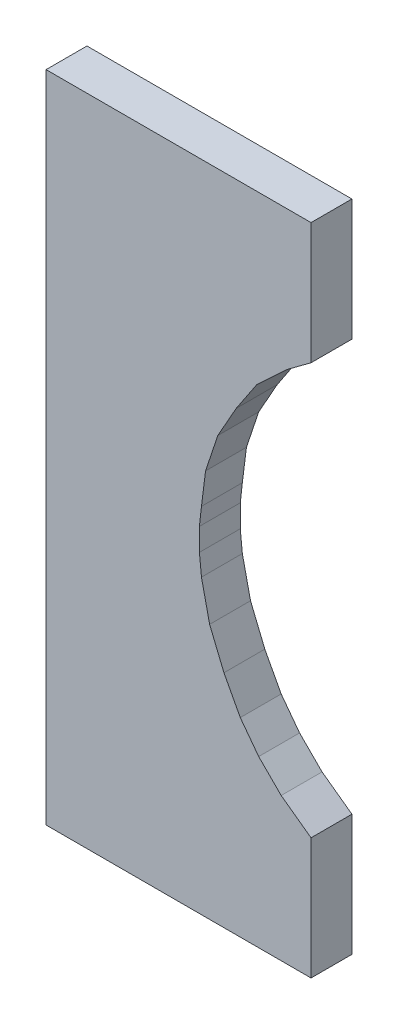
ISO-10303-21;
HEADER;
FILE_DESCRIPTION(('STEP AP214'),'2;1');
FILE_NAME('part.step','',(''),(''),'','','');
FILE_SCHEMA(('AUTOMOTIVE_DESIGN { 1 0 10303 214 1 1 1 1 }'));
ENDSEC;
DATA;
#1=APPLICATION_CONTEXT('core data for automotive mechanical design processes');
#2=APPLICATION_PROTOCOL_DEFINITION('international standard','automotive_design',2000,#1);
#3=PRODUCT_CONTEXT('',#1,'mechanical');
#4=PRODUCT('Part','Part','',(#3));
#5=PRODUCT_RELATED_PRODUCT_CATEGORY('part','',(#4));
#6=PRODUCT_DEFINITION_FORMATION('','',#4);
#7=PRODUCT_DEFINITION_CONTEXT('part definition',#1,'design');
#8=PRODUCT_DEFINITION('design','',#6,#7);
#9=PRODUCT_DEFINITION_SHAPE('','',#8);
#10=(LENGTH_UNIT() NAMED_UNIT(*) SI_UNIT(.MILLI.,.METRE.));
#11=(NAMED_UNIT(*) PLANE_ANGLE_UNIT() SI_UNIT($,.RADIAN.));
#12=(NAMED_UNIT(*) SI_UNIT($,.STERADIAN.) SOLID_ANGLE_UNIT());
#13=UNCERTAINTY_MEASURE_WITH_UNIT(LENGTH_MEASURE(1.E-05),#10,'distance_accuracy_value','');
#14=(GEOMETRIC_REPRESENTATION_CONTEXT(3) GLOBAL_UNCERTAINTY_ASSIGNED_CONTEXT((#13)) GLOBAL_UNIT_ASSIGNED_CONTEXT((#10,
#11,#12)) REPRESENTATION_CONTEXT('',''));
#15=CARTESIAN_POINT('',(0.,0.,0.));
#16=DIRECTION('',(0.,0.,1.));
#17=DIRECTION('',(1.,0.,0.));
#18=AXIS2_PLACEMENT_3D('',#15,#16,#17);
#19=CARTESIAN_POINT('',(-0.64800734,1.60000188,0.2));
#20=DIRECTION('',(0.,0.,1.));
#21=DIRECTION('',(1.,0.,0.));
#22=AXIS2_PLACEMENT_3D('',#19,#20,#21);
#23=PLANE('',#22);
#24=DIRECTION('',(0.,1.,0.));
#25=VECTOR('',#24,1.);
#26=CARTESIAN_POINT('',(0.64800734,1.60000188,0.2));
#27=LINE('',#26,#25);
#28=CARTESIAN_POINT('',(0.64800734,1.00612956,0.2));
#29=VERTEX_POINT('',#28);
#30=CARTESIAN_POINT('',(0.64800734,1.60000188,0.2));
#31=VERTEX_POINT('',#30);
#32=EDGE_CURVE('E225',#29,#31,#27,.T.);
#33=ORIENTED_EDGE('',*,*,#32,.T.);
#34=DIRECTION('',(1.,0.,0.));
#35=VECTOR('',#34,1.);
#36=CARTESIAN_POINT('',(-0.64800734,1.60000188,0.2));
#37=LINE('',#36,#35);
#38=CARTESIAN_POINT('',(-0.64800734,1.60000188,0.2));
#39=VERTEX_POINT('',#38);
#40=EDGE_CURVE('E228',#31,#39,#37,.F.);
#41=ORIENTED_EDGE('',*,*,#40,.T.);
#42=DIRECTION('',(0.,1.,0.));
#43=VECTOR('',#42,1.);
#44=CARTESIAN_POINT('',(-0.64800734,-1.59999934,0.2));
#45=LINE('',#44,#43);
#46=CARTESIAN_POINT('',(-0.64800734,-1.59999934,0.2));
#47=VERTEX_POINT('',#46);
#48=EDGE_CURVE('E156',#47,#39,#45,.T.);
#49=ORIENTED_EDGE('',*,*,#48,.F.);
#50=DIRECTION('',(1.,0.,0.));
#51=VECTOR('',#50,1.);
#52=CARTESIAN_POINT('',(-0.64800734,-1.59999934,0.2));
#53=LINE('',#52,#51);
#54=CARTESIAN_POINT('',(0.64800734,-1.59999934,0.2));
#55=VERTEX_POINT('',#54);
#56=EDGE_CURVE('E19',#47,#55,#53,.T.);
#57=ORIENTED_EDGE('',*,*,#56,.T.);
#58=DIRECTION('',(0.,1.,0.));
#59=VECTOR('',#58,1.);
#60=CARTESIAN_POINT('',(0.64800734,1.60000188,0.2));
#61=LINE('',#60,#59);
#62=CARTESIAN_POINT('',(0.648007339999998,-1.00612702,0.2));
#63=VERTEX_POINT('',#62);
#64=EDGE_CURVE('E151',#55,#63,#61,.T.);
#65=ORIENTED_EDGE('',*,*,#64,.T.);
#66=DIRECTION('',(-0.80890338608326,0.587941588921073,0.));
#67=VECTOR('',#66,1.);
#68=CARTESIAN_POINT('',(0.64800734,-1.00612702,0.2));
#69=LINE('',#68,#67);
#70=CARTESIAN_POINT('',(0.5019929,-0.8999982,0.2));
#71=VERTEX_POINT('',#70);
#72=EDGE_CURVE('E175',#63,#71,#69,.T.);
#73=ORIENTED_EDGE('',*,*,#72,.T.);
#74=DIRECTION('',(-0.707106781186547,0.707106781186548,0.));
#75=VECTOR('',#74,1.);
#76=CARTESIAN_POINT('',(0.5019929,-0.8999982,0.2));
#77=LINE('',#76,#75);
#78=CARTESIAN_POINT('',(0.39199312,-0.78999842,0.2));
#79=VERTEX_POINT('',#78);
#80=EDGE_CURVE('E181',#71,#79,#77,.T.);
#81=ORIENTED_EDGE('',*,*,#80,.T.);
#82=DIRECTION('',(-0.6,0.8,0.));
#83=VECTOR('',#82,1.);
#84=CARTESIAN_POINT('',(0.39199312,-0.78999842,0.2));
#85=LINE('',#84,#83);
#86=CARTESIAN_POINT('',(0.301993300000005,-0.669998659999998,0.2));
#87=VERTEX_POINT('',#86);
#88=EDGE_CURVE('E186',#79,#87,#85,.T.);
#89=ORIENTED_EDGE('',*,*,#88,.T.);
#90=DIRECTION('',(-0.470588235294118,0.88235294117647,0.));
#91=VECTOR('',#90,1.);
#92=CARTESIAN_POINT('',(0.3019933,-0.66999866,0.2));
#93=LINE('',#92,#91);
#94=CARTESIAN_POINT('',(0.221993459999983,-0.519998960000006,0.2));
#95=VERTEX_POINT('',#94);
#96=EDGE_CURVE('E189',#87,#95,#93,.T.);
#97=ORIENTED_EDGE('',*,*,#96,.T.);
#98=DIRECTION('',(-0.380749805254294,0.924678098474716,0.));
#99=VECTOR('',#98,1.);
#100=CARTESIAN_POINT('',(0.22199346,-0.51999896,0.2));
#101=LINE('',#100,#99);
#102=CARTESIAN_POINT('',(0.151993600000015,-0.3499993,0.2));
#103=VERTEX_POINT('',#102);
#104=EDGE_CURVE('E192',#95,#103,#101,.T.);
#105=ORIENTED_EDGE('',*,*,#104,.T.);
#106=DIRECTION('',(-0.216930457818656,0.976187060183953,0.));
#107=VECTOR('',#106,1.);
#108=CARTESIAN_POINT('',(0.1519936,-0.3499993,0.2));
#109=LINE('',#108,#107);
#110=CARTESIAN_POINT('',(0.11199368,-0.169999659999998,0.2));
#111=VERTEX_POINT('',#110);
#112=EDGE_CURVE('E195',#103,#111,#109,.T.);
#113=ORIENTED_EDGE('',*,*,#112,.T.);
#114=DIRECTION('',(-0.0995037190209989,0.995037190209989,0.));
#115=VECTOR('',#114,1.);
#116=CARTESIAN_POINT('',(0.11199368,-0.16999966,0.2));
#117=LINE('',#116,#115);
#118=CARTESIAN_POINT('',(0.1019937,-0.0699998600000053,0.2));
#119=VERTEX_POINT('',#118);
#120=EDGE_CURVE('E198',#111,#119,#117,.T.);
#121=ORIENTED_EDGE('',*,*,#120,.T.);
#122=DIRECTION('',(0.,1.,0.));
#123=VECTOR('',#122,1.);
#124=CARTESIAN_POINT('',(0.1019937,1.60000188,0.2));
#125=LINE('',#124,#123);
#126=CARTESIAN_POINT('',(0.101993699999997,0.0399999199999908,0.2));
#127=VERTEX_POINT('',#126);
#128=EDGE_CURVE('E201',#119,#127,#125,.T.);
#129=ORIENTED_EDGE('',*,*,#128,.T.);
#130=DIRECTION('',(0.110431526074846,0.993883734673619,0.));
#131=VECTOR('',#130,1.);
#132=CARTESIAN_POINT('',(0.1019937,0.03999992,0.2));
#133=LINE('',#132,#131);
#134=CARTESIAN_POINT('',(0.111993680000012,0.129999740000016,0.2));
#135=VERTEX_POINT('',#134);
#136=EDGE_CURVE('E204',#127,#135,#133,.T.);
#137=ORIENTED_EDGE('',*,*,#136,.T.);
#138=DIRECTION('',(0.124034734589208,0.992277876713668,0.));
#139=VECTOR('',#138,1.);
#140=CARTESIAN_POINT('',(0.11199368,0.12999974,0.2));
#141=LINE('',#140,#139);
#142=CARTESIAN_POINT('',(0.131993640000011,0.289999419999996,0.2));
#143=VERTEX_POINT('',#142);
#144=EDGE_CURVE('E207',#135,#143,#141,.T.);
#145=ORIENTED_EDGE('',*,*,#144,.T.);
#146=DIRECTION('',(0.316223749964347,0.948684636725232,0.));
#147=VECTOR('',#146,1.);
#148=CARTESIAN_POINT('',(0.13199364,0.28999942,0.2));
#149=LINE('',#148,#147);
#150=CARTESIAN_POINT('',(0.191993519999974,0.470001600000015,0.2));
#151=VERTEX_POINT('',#150);
#152=EDGE_CURVE('E210',#143,#151,#149,.T.);
#153=ORIENTED_EDGE('',*,*,#152,.T.);
#154=DIRECTION('',(0.490261239632559,0.871575537124549,0.));
#155=VECTOR('',#154,1.);
#156=CARTESIAN_POINT('',(0.19199352,0.4700016,0.2));
#157=LINE('',#156,#155);
#158=CARTESIAN_POINT('',(0.281993340000012,0.630001279999995,0.2));
#159=VERTEX_POINT('',#158);
#160=EDGE_CURVE('E213',#151,#159,#157,.T.);
#161=ORIENTED_EDGE('',*,*,#160,.T.);
#162=DIRECTION('',(0.55470019622523,0.832050294337843,0.));
#163=VECTOR('',#162,1.);
#164=CARTESIAN_POINT('',(0.28199334,0.63000128,0.2));
#165=LINE('',#164,#163);
#166=CARTESIAN_POINT('',(0.381993139999997,0.780000980000003,0.2));
#167=VERTEX_POINT('',#166);
#168=EDGE_CURVE('E216',#159,#167,#165,.T.);
#169=ORIENTED_EDGE('',*,*,#168,.T.);
#170=DIRECTION('',(0.731055268242869,0.682318250360011,0.));
#171=VECTOR('',#170,1.);
#172=CARTESIAN_POINT('',(0.38199314,0.78000098,0.2));
#173=LINE('',#172,#171);
#174=CARTESIAN_POINT('',(0.531992840000007,0.920000699999989,0.2));
#175=VERTEX_POINT('',#174);
#176=EDGE_CURVE('E219',#167,#175,#173,.T.);
#177=ORIENTED_EDGE('',*,*,#176,.T.);
#178=DIRECTION('',(0.802920527365337,0.596086090036808,0.));
#179=VECTOR('',#178,1.);
#180=CARTESIAN_POINT('',(0.53199284,0.9200007,0.2));
#181=LINE('',#180,#179);
#182=EDGE_CURVE('E222',#175,#29,#181,.T.);
#183=ORIENTED_EDGE('',*,*,#182,.T.);
#184=EDGE_LOOP('',(#33,#41,#49,#57,#65,#73,#81,#89,#97,#105,#113,#121,#129,#137,#145,#153,#161,
#169,#177,#183));
#185=FACE_BOUND('',#184,.T.);
#186=ADVANCED_FACE('F16',(#185),#23,.T.);
#187=CARTESIAN_POINT('',(-0.64800734,-1.59999934,0.));
#188=DIRECTION('',(-1.,0.,0.));
#189=DIRECTION('',(0.,0.,1.));
#190=AXIS2_PLACEMENT_3D('',#187,#188,#189);
#191=PLANE('',#190);
#192=DIRECTION('',(0.,0.,1.));
#193=VECTOR('',#192,1.);
#194=CARTESIAN_POINT('',(-0.64800734,1.60000188,0.));
#195=LINE('',#194,#193);
#196=CARTESIAN_POINT('',(-0.64800734,1.60000188,0.));
#197=VERTEX_POINT('',#196);
#198=EDGE_CURVE('E282',#197,#39,#195,.T.);
#199=ORIENTED_EDGE('',*,*,#198,.F.);
#200=DIRECTION('',(0.,1.,0.));
#201=VECTOR('',#200,1.);
#202=CARTESIAN_POINT('',(-0.64800734,1.60000188,0.));
#203=LINE('',#202,#201);
#204=CARTESIAN_POINT('',(-0.64800734,-1.59999934,0.));
#205=VERTEX_POINT('',#204);
#206=EDGE_CURVE('E288',#197,#205,#203,.F.);
#207=ORIENTED_EDGE('',*,*,#206,.T.);
#208=DIRECTION('',(0.,0.,-1.));
#209=VECTOR('',#208,1.);
#210=CARTESIAN_POINT('',(-0.64800734,-1.59999934,0.));
#211=LINE('',#210,#209);
#212=EDGE_CURVE('E170',#47,#205,#211,.T.);
#213=ORIENTED_EDGE('',*,*,#212,.F.);
#214=ORIENTED_EDGE('',*,*,#48,.T.);
#215=EDGE_LOOP('',(#199,#207,#213,#214));
#216=FACE_BOUND('',#215,.T.);
#217=ADVANCED_FACE('F440',(#216),#191,.T.);
#218=CARTESIAN_POINT('',(0.64800734,-1.59999934,0.));
#219=DIRECTION('',(0.,-1.,0.));
#220=DIRECTION('',(0.,0.,-1.));
#221=AXIS2_PLACEMENT_3D('',#218,#219,#220);
#222=PLANE('',#221);
#223=ORIENTED_EDGE('',*,*,#212,.T.);
#224=DIRECTION('',(1.,0.,0.));
#225=VECTOR('',#224,1.);
#226=CARTESIAN_POINT('',(-0.64800734,-1.59999934,0.));
#227=LINE('',#226,#225);
#228=CARTESIAN_POINT('',(0.64800734,-1.59999934,0.));
#229=VERTEX_POINT('',#228);
#230=EDGE_CURVE('E164',#205,#229,#227,.T.);
#231=ORIENTED_EDGE('',*,*,#230,.T.);
#232=DIRECTION('',(0.,0.,-1.));
#233=VECTOR('',#232,1.);
#234=CARTESIAN_POINT('',(0.64800734,-1.59999934,0.));
#235=LINE('',#234,#233);
#236=EDGE_CURVE('E161',#55,#229,#235,.T.);
#237=ORIENTED_EDGE('',*,*,#236,.F.);
#238=ORIENTED_EDGE('',*,*,#56,.F.);
#239=EDGE_LOOP('',(#223,#231,#237,#238));
#240=FACE_BOUND('',#239,.T.);
#241=ADVANCED_FACE('F162',(#240),#222,.T.);
#242=CARTESIAN_POINT('',(0.64800734,-1.00612702,0.));
#243=DIRECTION('',(1.,0.,0.));
#244=DIRECTION('',(0.,0.,-1.));
#245=AXIS2_PLACEMENT_3D('',#242,#243,#244);
#246=PLANE('',#245);
#247=ORIENTED_EDGE('',*,*,#236,.T.);
#248=DIRECTION('',(0.,1.,0.));
#249=VECTOR('',#248,1.);
#250=CARTESIAN_POINT('',(0.64800734,1.60000188,0.));
#251=LINE('',#250,#249);
#252=CARTESIAN_POINT('',(0.648007339999998,-1.00612702,0.));
#253=VERTEX_POINT('',#252);
#254=EDGE_CURVE('E294',#229,#253,#251,.T.);
#255=ORIENTED_EDGE('',*,*,#254,.T.);
#256=DIRECTION('',(0.,0.,1.));
#257=VECTOR('',#256,1.);
#258=CARTESIAN_POINT('',(0.64800733999999,-1.00612702000001,0.));
#259=LINE('',#258,#257);
#260=EDGE_CURVE('E169',#63,#253,#259,.F.);
#261=ORIENTED_EDGE('',*,*,#260,.F.);
#262=ORIENTED_EDGE('',*,*,#64,.F.);
#263=EDGE_LOOP('',(#247,#255,#261,#262));
#264=FACE_BOUND('',#263,.T.);
#265=ADVANCED_FACE('F172',(#264),#246,.T.);
#266=CARTESIAN_POINT('',(0.5019929,-0.8999982,0.));
#267=DIRECTION('',(0.587941588921149,0.808903386083205,0.));
#268=DIRECTION('',(-0.808903386083205,0.587941588921149,0.));
#269=AXIS2_PLACEMENT_3D('',#266,#267,#268);
#270=PLANE('',#269);
#271=ORIENTED_EDGE('',*,*,#260,.T.);
#272=DIRECTION('',(-0.80890338608326,0.587941588921073,0.));
#273=VECTOR('',#272,1.);
#274=CARTESIAN_POINT('',(0.64800734,-1.00612702,0.));
#275=LINE('',#274,#273);
#276=CARTESIAN_POINT('',(0.5019929,-0.8999982,0.));
#277=VERTEX_POINT('',#276);
#278=EDGE_CURVE('E297',#253,#277,#275,.T.);
#279=ORIENTED_EDGE('',*,*,#278,.T.);
#280=DIRECTION('',(0.,0.,1.));
#281=VECTOR('',#280,1.);
#282=CARTESIAN_POINT('',(0.5019929,-0.8999982,0.));
#283=LINE('',#282,#281);
#284=EDGE_CURVE('E237',#71,#277,#283,.F.);
#285=ORIENTED_EDGE('',*,*,#284,.F.);
#286=ORIENTED_EDGE('',*,*,#72,.F.);
#287=EDGE_LOOP('',(#271,#279,#285,#286));
#288=FACE_BOUND('',#287,.T.);
#289=ADVANCED_FACE('F437',(#288),#270,.T.);
#290=CARTESIAN_POINT('',(0.39199312,-0.78999842,0.));
#291=DIRECTION('',(0.707106781186548,0.707106781186548,0.));
#292=DIRECTION('',(-0.707106781186548,0.707106781186548,0.));
#293=AXIS2_PLACEMENT_3D('',#290,#291,#292);
#294=PLANE('',#293);
#295=ORIENTED_EDGE('',*,*,#284,.T.);
#296=DIRECTION('',(-0.707106781186547,0.707106781186548,0.));
#297=VECTOR('',#296,1.);
#298=CARTESIAN_POINT('',(0.5019929,-0.8999982,0.));
#299=LINE('',#298,#297);
#300=CARTESIAN_POINT('',(0.39199312,-0.78999842,0.));
#301=VERTEX_POINT('',#300);
#302=EDGE_CURVE('E301',#277,#301,#299,.T.);
#303=ORIENTED_EDGE('',*,*,#302,.T.);
#304=DIRECTION('',(0.,0.,1.));
#305=VECTOR('',#304,1.);
#306=CARTESIAN_POINT('',(0.39199312,-0.78999842,0.));
#307=LINE('',#306,#305);
#308=EDGE_CURVE('E240',#79,#301,#307,.F.);
#309=ORIENTED_EDGE('',*,*,#308,.F.);
#310=ORIENTED_EDGE('',*,*,#80,.F.);
#311=EDGE_LOOP('',(#295,#303,#309,#310));
#312=FACE_BOUND('',#311,.T.);
#313=ADVANCED_FACE('F433',(#312),#294,.T.);
#314=CARTESIAN_POINT('',(0.3019933,-0.66999866,0.));
#315=DIRECTION('',(0.8,0.6,0.));
#316=DIRECTION('',(-0.6,0.8,0.));
#317=AXIS2_PLACEMENT_3D('',#314,#315,#316);
#318=PLANE('',#317);
#319=ORIENTED_EDGE('',*,*,#308,.T.);
#320=DIRECTION('',(-0.6,0.8,0.));
#321=VECTOR('',#320,1.);
#322=CARTESIAN_POINT('',(0.39199312,-0.78999842,0.));
#323=LINE('',#322,#321);
#324=CARTESIAN_POINT('',(0.301993300000005,-0.669998659999998,0.));
#325=VERTEX_POINT('',#324);
#326=EDGE_CURVE('E305',#301,#325,#323,.T.);
#327=ORIENTED_EDGE('',*,*,#326,.T.);
#328=DIRECTION('',(0.,0.,1.));
#329=VECTOR('',#328,1.);
#330=CARTESIAN_POINT('',(0.301993300000018,-0.669998659999991,0.));
#331=LINE('',#330,#329);
#332=EDGE_CURVE('E243',#87,#325,#331,.F.);
#333=ORIENTED_EDGE('',*,*,#332,.F.);
#334=ORIENTED_EDGE('',*,*,#88,.F.);
#335=EDGE_LOOP('',(#319,#327,#333,#334));
#336=FACE_BOUND('',#335,.T.);
#337=ADVANCED_FACE('F428',(#336),#318,.T.);
#338=CARTESIAN_POINT('',(0.22199346,-0.51999896,0.));
#339=DIRECTION('',(0.882352941176415,0.470588235294222,0.));
#340=DIRECTION('',(-0.470588235294222,0.882352941176415,0.));
#341=AXIS2_PLACEMENT_3D('',#338,#339,#340);
#342=PLANE('',#341);
#343=ORIENTED_EDGE('',*,*,#332,.T.);
#344=DIRECTION('',(-0.470588235294118,0.88235294117647,0.));
#345=VECTOR('',#344,1.);
#346=CARTESIAN_POINT('',(0.3019933,-0.66999866,0.));
#347=LINE('',#346,#345);
#348=CARTESIAN_POINT('',(0.221993459999983,-0.519998960000006,0.));
#349=VERTEX_POINT('',#348);
#350=EDGE_CURVE('E309',#325,#349,#347,.T.);
#351=ORIENTED_EDGE('',*,*,#350,.T.);
#352=DIRECTION('',(0.,0.,1.));
#353=VECTOR('',#352,1.);
#354=CARTESIAN_POINT('',(0.221993459999936,-0.519998960000027,0.));
#355=LINE('',#354,#353);
#356=EDGE_CURVE('E246',#95,#349,#355,.F.);
#357=ORIENTED_EDGE('',*,*,#356,.F.);
#358=ORIENTED_EDGE('',*,*,#96,.F.);
#359=EDGE_LOOP('',(#343,#351,#357,#358));
#360=FACE_BOUND('',#359,.T.);
#361=ADVANCED_FACE('F423',(#360),#342,.T.);
#362=CARTESIAN_POINT('',(0.1519936,-0.3499993,0.));
#363=DIRECTION('',(0.924678098474861,0.380749805253943,0.));
#364=DIRECTION('',(-0.380749805253943,0.924678098474861,0.));
#365=AXIS2_PLACEMENT_3D('',#362,#363,#364);
#366=PLANE('',#365);
#367=ORIENTED_EDGE('',*,*,#356,.T.);
#368=DIRECTION('',(-0.380749805254294,0.924678098474716,0.));
#369=VECTOR('',#368,1.);
#370=CARTESIAN_POINT('',(0.22199346,-0.51999896,0.));
#371=LINE('',#370,#369);
#372=CARTESIAN_POINT('',(0.151993600000015,-0.3499993,0.));
#373=VERTEX_POINT('',#372);
#374=EDGE_CURVE('E313',#349,#373,#371,.T.);
#375=ORIENTED_EDGE('',*,*,#374,.T.);
#376=DIRECTION('',(0.,0.,1.));
#377=VECTOR('',#376,1.);
#378=CARTESIAN_POINT('',(0.151993600000058,-0.349999299999987,0.));
#379=LINE('',#378,#377);
#380=EDGE_CURVE('E249',#103,#373,#379,.F.);
#381=ORIENTED_EDGE('',*,*,#380,.F.);
#382=ORIENTED_EDGE('',*,*,#104,.F.);
#383=EDGE_LOOP('',(#367,#375,#381,#382));
#384=FACE_BOUND('',#383,.T.);
#385=ADVANCED_FACE('F418',(#384),#366,.T.);
#386=CARTESIAN_POINT('',(0.11199368,-0.16999966,0.));
#387=DIRECTION('',(0.976187060183882,0.216930457818974,0.));
#388=DIRECTION('',(-0.216930457818974,0.976187060183882,0.));
#389=AXIS2_PLACEMENT_3D('',#386,#387,#388);
#390=PLANE('',#389);
#391=ORIENTED_EDGE('',*,*,#380,.T.);
#392=DIRECTION('',(-0.216930457818656,0.976187060183953,0.));
#393=VECTOR('',#392,1.);
#394=CARTESIAN_POINT('',(0.1519936,-0.3499993,0.));
#395=LINE('',#394,#393);
#396=CARTESIAN_POINT('',(0.11199368,-0.169999659999999,0.));
#397=VERTEX_POINT('',#396);
#398=EDGE_CURVE('E317',#373,#397,#395,.T.);
#399=ORIENTED_EDGE('',*,*,#398,.T.);
#400=DIRECTION('',(0.,0.,1.));
#401=VECTOR('',#400,1.);
#402=CARTESIAN_POINT('',(0.11199368,-0.16999966,0.));
#403=LINE('',#402,#401);
#404=EDGE_CURVE('E252',#111,#397,#403,.F.);
#405=ORIENTED_EDGE('',*,*,#404,.F.);
#406=ORIENTED_EDGE('',*,*,#112,.F.);
#407=EDGE_LOOP('',(#391,#399,#405,#406));
#408=FACE_BOUND('',#407,.T.);
#409=ADVANCED_FACE('F413',(#408),#390,.T.);
#410=CARTESIAN_POINT('',(0.1019937,-0.06999986,0.));
#411=DIRECTION('',(0.995037190209989,0.0995037190209989,0.));
#412=DIRECTION('',(-0.0995037190209989,0.995037190209989,0.));
#413=AXIS2_PLACEMENT_3D('',#410,#411,#412);
#414=PLANE('',#413);
#415=ORIENTED_EDGE('',*,*,#404,.T.);
#416=DIRECTION('',(-0.0995037190209989,0.995037190209989,0.));
#417=VECTOR('',#416,1.);
#418=CARTESIAN_POINT('',(0.11199368,-0.16999966,0.));
#419=LINE('',#418,#417);
#420=CARTESIAN_POINT('',(0.1019937,-0.0699998600000027,0.));
#421=VERTEX_POINT('',#420);
#422=EDGE_CURVE('E320',#397,#421,#419,.T.);
#423=ORIENTED_EDGE('',*,*,#422,.T.);
#424=DIRECTION('',(0.,0.,-1.));
#425=VECTOR('',#424,1.);
#426=CARTESIAN_POINT('',(0.1019937,-0.06999986,0.));
#427=LINE('',#426,#425);
#428=EDGE_CURVE('E255',#119,#421,#427,.T.);
#429=ORIENTED_EDGE('',*,*,#428,.F.);
#430=ORIENTED_EDGE('',*,*,#120,.F.);
#431=EDGE_LOOP('',(#415,#423,#429,#430));
#432=FACE_BOUND('',#431,.T.);
#433=ADVANCED_FACE('F408',(#432),#414,.T.);
#434=CARTESIAN_POINT('',(0.1019937,0.03999992,0.));
#435=DIRECTION('',(1.,0.,0.));
#436=DIRECTION('',(0.,0.,-1.));
#437=AXIS2_PLACEMENT_3D('',#434,#435,#436);
#438=PLANE('',#437);
#439=ORIENTED_EDGE('',*,*,#428,.T.);
#440=DIRECTION('',(0.,1.,0.));
#441=VECTOR('',#440,1.);
#442=CARTESIAN_POINT('',(0.1019937,1.60000188,0.));
#443=LINE('',#442,#441);
#444=CARTESIAN_POINT('',(0.101993699999997,0.0399999199999956,0.));
#445=VERTEX_POINT('',#444);
#446=EDGE_CURVE('E324',#421,#445,#443,.T.);
#447=ORIENTED_EDGE('',*,*,#446,.T.);
#448=DIRECTION('',(0.,0.,1.));
#449=VECTOR('',#448,1.);
#450=CARTESIAN_POINT('',(0.10199369999999,0.0399999200000011,0.));
#451=LINE('',#450,#449);
#452=EDGE_CURVE('E258',#127,#445,#451,.F.);
#453=ORIENTED_EDGE('',*,*,#452,.F.);
#454=ORIENTED_EDGE('',*,*,#128,.F.);
#455=EDGE_LOOP('',(#439,#447,#453,#454));
#456=FACE_BOUND('',#455,.T.);
#457=ADVANCED_FACE('F403',(#456),#438,.T.);
#458=CARTESIAN_POINT('',(0.11199368,0.12999974,0.));
#459=DIRECTION('',(0.993883734673607,-0.110431526074956,0.));
#460=DIRECTION('',(0.110431526074956,0.993883734673607,0.));
#461=AXIS2_PLACEMENT_3D('',#458,#459,#460);
#462=PLANE('',#461);
#463=ORIENTED_EDGE('',*,*,#452,.T.);
#464=DIRECTION('',(0.110431526074846,0.993883734673619,0.));
#465=VECTOR('',#464,1.);
#466=CARTESIAN_POINT('',(0.1019937,0.03999992,0.));
#467=LINE('',#466,#465);
#468=CARTESIAN_POINT('',(0.111993680000011,0.129999740000007,0.));
#469=VERTEX_POINT('',#468);
#470=EDGE_CURVE('E328',#445,#469,#467,.T.);
#471=ORIENTED_EDGE('',*,*,#470,.T.);
#472=DIRECTION('',(0.,0.,1.));
#473=VECTOR('',#472,1.);
#474=CARTESIAN_POINT('',(0.11199368000004,0.129999739999995,0.));
#475=LINE('',#474,#473);
#476=EDGE_CURVE('E261',#135,#469,#475,.F.);
#477=ORIENTED_EDGE('',*,*,#476,.F.);
#478=ORIENTED_EDGE('',*,*,#136,.F.);
#479=EDGE_LOOP('',(#463,#471,#477,#478));
#480=FACE_BOUND('',#479,.T.);
#481=ADVANCED_FACE('F398',(#480),#462,.T.);
#482=CARTESIAN_POINT('',(0.13199364,0.28999942,0.));
#483=DIRECTION('',(0.992277876713698,-0.124034734588962,0.));
#484=DIRECTION('',(0.124034734588962,0.992277876713698,0.));
#485=AXIS2_PLACEMENT_3D('',#482,#483,#484);
#486=PLANE('',#485);
#487=ORIENTED_EDGE('',*,*,#476,.T.);
#488=DIRECTION('',(0.124034734589208,0.992277876713668,0.));
#489=VECTOR('',#488,1.);
#490=CARTESIAN_POINT('',(0.11199368,0.12999974,0.));
#491=LINE('',#490,#489);
#492=CARTESIAN_POINT('',(0.131993640000011,0.289999419999996,0.));
#493=VERTEX_POINT('',#492);
#494=EDGE_CURVE('E332',#469,#493,#491,.T.);
#495=ORIENTED_EDGE('',*,*,#494,.T.);
#496=DIRECTION('',(0.,0.,1.));
#497=VECTOR('',#496,1.);
#498=CARTESIAN_POINT('',(0.131993640000046,0.289999419999984,0.));
#499=LINE('',#498,#497);
#500=EDGE_CURVE('E264',#143,#493,#499,.F.);
#501=ORIENTED_EDGE('',*,*,#500,.F.);
#502=ORIENTED_EDGE('',*,*,#144,.F.);
#503=EDGE_LOOP('',(#487,#495,#501,#502));
#504=FACE_BOUND('',#503,.T.);
#505=ADVANCED_FACE('F393',(#504),#486,.T.);
#506=CARTESIAN_POINT('',(0.19199352,0.4700016,0.));
#507=DIRECTION('',(0.948684636725313,-0.316223749964105,0.));
#508=DIRECTION('',(0.316223749964105,0.948684636725313,0.));
#509=AXIS2_PLACEMENT_3D('',#506,#507,#508);
#510=PLANE('',#509);
#511=ORIENTED_EDGE('',*,*,#500,.T.);
#512=DIRECTION('',(0.316223749964347,0.948684636725232,0.));
#513=VECTOR('',#512,1.);
#514=CARTESIAN_POINT('',(0.13199364,0.28999942,0.));
#515=LINE('',#514,#513);
#516=CARTESIAN_POINT('',(0.191993519999974,0.470001600000015,0.));
#517=VERTEX_POINT('',#516);
#518=EDGE_CURVE('E336',#493,#517,#515,.T.);
#519=ORIENTED_EDGE('',*,*,#518,.T.);
#520=DIRECTION('',(0.,0.,1.));
#521=VECTOR('',#520,1.);
#522=CARTESIAN_POINT('',(0.191993519999896,0.470001600000059,0.));
#523=LINE('',#522,#521);
#524=EDGE_CURVE('E267',#151,#517,#523,.F.);
#525=ORIENTED_EDGE('',*,*,#524,.F.);
#526=ORIENTED_EDGE('',*,*,#152,.F.);
#527=EDGE_LOOP('',(#511,#519,#525,#526));
#528=FACE_BOUND('',#527,.T.);
#529=ADVANCED_FACE('F388',(#528),#510,.T.);
#530=CARTESIAN_POINT('',(0.28199334,0.63000128,0.));
#531=DIRECTION('',(0.871575537124229,-0.490261239633129,0.));
#532=DIRECTION('',(0.490261239633129,0.871575537124229,0.));
#533=AXIS2_PLACEMENT_3D('',#530,#531,#532);
#534=PLANE('',#533);
#535=ORIENTED_EDGE('',*,*,#524,.T.);
#536=DIRECTION('',(0.490261239632559,0.871575537124549,0.));
#537=VECTOR('',#536,1.);
#538=CARTESIAN_POINT('',(0.19199352,0.4700016,0.));
#539=LINE('',#538,#537);
#540=CARTESIAN_POINT('',(0.281993340000011,0.630001279999994,0.));
#541=VERTEX_POINT('',#540);
#542=EDGE_CURVE('E340',#517,#541,#539,.T.);
#543=ORIENTED_EDGE('',*,*,#542,.T.);
#544=DIRECTION('',(0.,0.,1.));
#545=VECTOR('',#544,1.);
#546=CARTESIAN_POINT('',(0.281993340000042,0.630001279999972,0.));
#547=LINE('',#546,#545);
#548=EDGE_CURVE('E270',#159,#541,#547,.F.);
#549=ORIENTED_EDGE('',*,*,#548,.F.);
#550=ORIENTED_EDGE('',*,*,#160,.F.);
#551=EDGE_LOOP('',(#535,#543,#549,#550));
#552=FACE_BOUND('',#551,.T.);
#553=ADVANCED_FACE('F383',(#552),#534,.T.);
#554=CARTESIAN_POINT('',(0.38199314,0.78000098,0.));
#555=DIRECTION('',(0.832050294337998,-0.554700196224998,0.));
#556=DIRECTION('',(0.554700196224998,0.832050294337998,0.));
#557=AXIS2_PLACEMENT_3D('',#554,#555,#556);
#558=PLANE('',#557);
#559=ORIENTED_EDGE('',*,*,#548,.T.);
#560=DIRECTION('',(0.55470019622523,0.832050294337843,0.));
#561=VECTOR('',#560,1.);
#562=CARTESIAN_POINT('',(0.28199334,0.63000128,0.));
#563=LINE('',#562,#561);
#564=CARTESIAN_POINT('',(0.381993139999997,0.780000980000004,0.));
#565=VERTEX_POINT('',#564);
#566=EDGE_CURVE('E344',#541,#565,#563,.T.);
#567=ORIENTED_EDGE('',*,*,#566,.T.);
#568=DIRECTION('',(0.,0.,1.));
#569=VECTOR('',#568,1.);
#570=CARTESIAN_POINT('',(0.381993139999987,0.780000980000015,0.));
#571=LINE('',#570,#569);
#572=EDGE_CURVE('E273',#167,#565,#571,.F.);
#573=ORIENTED_EDGE('',*,*,#572,.F.);
#574=ORIENTED_EDGE('',*,*,#168,.F.);
#575=EDGE_LOOP('',(#559,#567,#573,#574));
#576=FACE_BOUND('',#575,.T.);
#577=ADVANCED_FACE('F378',(#576),#558,.T.);
#578=CARTESIAN_POINT('',(0.53199284,0.9200007,0.));
#579=DIRECTION('',(0.68231825035994,-0.731055268242936,0.));
#580=DIRECTION('',(0.731055268242936,0.68231825035994,0.));
#581=AXIS2_PLACEMENT_3D('',#578,#579,#580);
#582=PLANE('',#581);
#583=ORIENTED_EDGE('',*,*,#572,.T.);
#584=DIRECTION('',(0.731055268242869,0.682318250360011,0.));
#585=VECTOR('',#584,1.);
#586=CARTESIAN_POINT('',(0.38199314,0.78000098,0.));
#587=LINE('',#586,#585);
#588=CARTESIAN_POINT('',(0.531992840000008,0.92000069999999,0.));
#589=VERTEX_POINT('',#588);
#590=EDGE_CURVE('E347',#565,#589,#587,.T.);
#591=ORIENTED_EDGE('',*,*,#590,.T.);
#592=DIRECTION('',(0.,0.,1.));
#593=VECTOR('',#592,1.);
#594=CARTESIAN_POINT('',(0.531992840000031,0.920000699999959,0.));
#595=LINE('',#594,#593);
#596=EDGE_CURVE('E276',#175,#589,#595,.F.);
#597=ORIENTED_EDGE('',*,*,#596,.F.);
#598=ORIENTED_EDGE('',*,*,#176,.F.);
#599=EDGE_LOOP('',(#583,#591,#597,#598));
#600=FACE_BOUND('',#599,.T.);
#601=ADVANCED_FACE('F373',(#600),#582,.T.);
#602=CARTESIAN_POINT('',(0.64800734,1.00612956,0.));
#603=DIRECTION('',(0.596086090037093,-0.802920527365125,0.));
#604=DIRECTION('',(0.802920527365125,0.596086090037093,0.));
#605=AXIS2_PLACEMENT_3D('',#602,#603,#604);
#606=PLANE('',#605);
#607=ORIENTED_EDGE('',*,*,#596,.T.);
#608=DIRECTION('',(0.802920527365337,0.596086090036808,0.));
#609=VECTOR('',#608,1.);
#610=CARTESIAN_POINT('',(0.53199284,0.9200007,0.));
#611=LINE('',#610,#609);
#612=CARTESIAN_POINT('',(0.64800734,1.00612956,0.));
#613=VERTEX_POINT('',#612);
#614=EDGE_CURVE('E351',#589,#613,#611,.T.);
#615=ORIENTED_EDGE('',*,*,#614,.T.);
#616=DIRECTION('',(0.,0.,-1.));
#617=VECTOR('',#616,1.);
#618=CARTESIAN_POINT('',(0.64800734,1.00612956,0.));
#619=LINE('',#618,#617);
#620=EDGE_CURVE('E279',#29,#613,#619,.T.);
#621=ORIENTED_EDGE('',*,*,#620,.F.);
#622=ORIENTED_EDGE('',*,*,#182,.F.);
#623=EDGE_LOOP('',(#607,#615,#621,#622));
#624=FACE_BOUND('',#623,.T.);
#625=ADVANCED_FACE('F368',(#624),#606,.T.);
#626=CARTESIAN_POINT('',(0.64800734,1.60000188,0.));
#627=DIRECTION('',(1.,0.,0.));
#628=DIRECTION('',(0.,0.,-1.));
#629=AXIS2_PLACEMENT_3D('',#626,#627,#628);
#630=PLANE('',#629);
#631=ORIENTED_EDGE('',*,*,#620,.T.);
#632=DIRECTION('',(0.,1.,0.));
#633=VECTOR('',#632,1.);
#634=CARTESIAN_POINT('',(0.64800734,1.60000188,0.));
#635=LINE('',#634,#633);
#636=CARTESIAN_POINT('',(0.64800734,1.60000188,0.));
#637=VERTEX_POINT('',#636);
#638=EDGE_CURVE('E26',#613,#637,#635,.T.);
#639=ORIENTED_EDGE('',*,*,#638,.T.);
#640=DIRECTION('',(0.,0.,1.));
#641=VECTOR('',#640,1.);
#642=CARTESIAN_POINT('',(0.64800734,1.60000188,0.));
#643=LINE('',#642,#641);
#644=EDGE_CURVE('E34',#31,#637,#643,.F.);
#645=ORIENTED_EDGE('',*,*,#644,.F.);
#646=ORIENTED_EDGE('',*,*,#32,.F.);
#647=EDGE_LOOP('',(#631,#639,#645,#646));
#648=FACE_BOUND('',#647,.T.);
#649=ADVANCED_FACE('F360',(#648),#630,.T.);
#650=CARTESIAN_POINT('',(-0.64800734,1.60000188,0.));
#651=DIRECTION('',(0.,1.,0.));
#652=DIRECTION('',(0.,0.,1.));
#653=AXIS2_PLACEMENT_3D('',#650,#651,#652);
#654=PLANE('',#653);
#655=ORIENTED_EDGE('',*,*,#644,.T.);
#656=DIRECTION('',(1.,0.,0.));
#657=VECTOR('',#656,1.);
#658=CARTESIAN_POINT('',(-0.64800734,1.60000188,0.));
#659=LINE('',#658,#657);
#660=EDGE_CURVE('E11',#637,#197,#659,.F.);
#661=ORIENTED_EDGE('',*,*,#660,.T.);
#662=ORIENTED_EDGE('',*,*,#198,.T.);
#663=ORIENTED_EDGE('',*,*,#40,.F.);
#664=EDGE_LOOP('',(#655,#661,#662,#663));
#665=FACE_BOUND('',#664,.T.);
#666=ADVANCED_FACE('F441',(#665),#654,.T.);
#667=CARTESIAN_POINT('',(-0.64800734,1.60000188,0.));
#668=DIRECTION('',(0.,0.,1.));
#669=DIRECTION('',(1.,0.,0.));
#670=AXIS2_PLACEMENT_3D('',#667,#668,#669);
#671=PLANE('',#670);
#672=ORIENTED_EDGE('',*,*,#638,.F.);
#673=ORIENTED_EDGE('',*,*,#614,.F.);
#674=ORIENTED_EDGE('',*,*,#590,.F.);
#675=ORIENTED_EDGE('',*,*,#566,.F.);
#676=ORIENTED_EDGE('',*,*,#542,.F.);
#677=ORIENTED_EDGE('',*,*,#518,.F.);
#678=ORIENTED_EDGE('',*,*,#494,.F.);
#679=ORIENTED_EDGE('',*,*,#470,.F.);
#680=ORIENTED_EDGE('',*,*,#446,.F.);
#681=ORIENTED_EDGE('',*,*,#422,.F.);
#682=ORIENTED_EDGE('',*,*,#398,.F.);
#683=ORIENTED_EDGE('',*,*,#374,.F.);
#684=ORIENTED_EDGE('',*,*,#350,.F.);
#685=ORIENTED_EDGE('',*,*,#326,.F.);
#686=ORIENTED_EDGE('',*,*,#302,.F.);
#687=ORIENTED_EDGE('',*,*,#278,.F.);
#688=ORIENTED_EDGE('',*,*,#254,.F.);
#689=ORIENTED_EDGE('',*,*,#230,.F.);
#690=ORIENTED_EDGE('',*,*,#206,.F.);
#691=ORIENTED_EDGE('',*,*,#660,.F.);
#692=EDGE_LOOP('',(#672,#673,#674,#675,#676,#677,#678,#679,#680,#681,#682,#683,#684,#685,#686,
#687,#688,#689,#690,#691));
#693=FACE_BOUND('',#692,.T.);
#694=ADVANCED_FACE('F365',(#693),#671,.F.);
#695=CLOSED_SHELL('',(#186,#217,#241,#265,#289,#313,#337,#361,#385,#409,#433,#457,#481,#505,
#529,#553,#577,#601,#625,#649,#666,#694));
#696=MANIFOLD_SOLID_BREP('B1',#695);
#697=ADVANCED_BREP_SHAPE_REPRESENTATION('',(#18,#696),#14);
#698=SHAPE_DEFINITION_REPRESENTATION(#9,#697);
ENDSEC;
END-ISO-10303-21;
